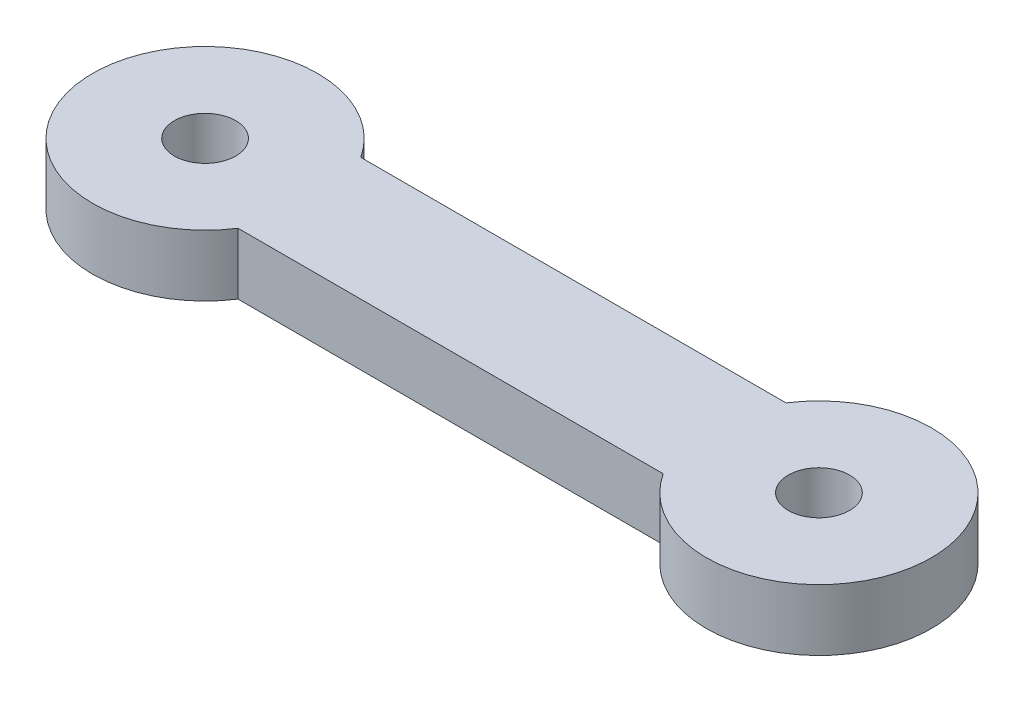
ISO-10303-21;
HEADER;
FILE_DESCRIPTION(('STEP AP214'),'2;1');
FILE_NAME('part.step','',(''),(''),'','','');
FILE_SCHEMA(('AUTOMOTIVE_DESIGN { 1 0 10303 214 1 1 1 1 }'));
ENDSEC;
DATA;
#1=APPLICATION_CONTEXT('core data for automotive mechanical design processes');
#2=APPLICATION_PROTOCOL_DEFINITION('international standard','automotive_design',2000,#1);
#3=PRODUCT_CONTEXT('',#1,'mechanical');
#4=PRODUCT('Part','Part','',(#3));
#5=PRODUCT_RELATED_PRODUCT_CATEGORY('part','',(#4));
#6=PRODUCT_DEFINITION_FORMATION('','',#4);
#7=PRODUCT_DEFINITION_CONTEXT('part definition',#1,'design');
#8=PRODUCT_DEFINITION('design','',#6,#7);
#9=PRODUCT_DEFINITION_SHAPE('','',#8);
#10=(LENGTH_UNIT() NAMED_UNIT(*) SI_UNIT(.MILLI.,.METRE.));
#11=(NAMED_UNIT(*) PLANE_ANGLE_UNIT() SI_UNIT($,.RADIAN.));
#12=(NAMED_UNIT(*) SI_UNIT($,.STERADIAN.) SOLID_ANGLE_UNIT());
#13=UNCERTAINTY_MEASURE_WITH_UNIT(LENGTH_MEASURE(1.E-05),#10,'distance_accuracy_value','');
#14=(GEOMETRIC_REPRESENTATION_CONTEXT(3) GLOBAL_UNCERTAINTY_ASSIGNED_CONTEXT((#13)) GLOBAL_UNIT_ASSIGNED_CONTEXT((#10,
#11,#12)) REPRESENTATION_CONTEXT('',''));
#15=CARTESIAN_POINT('',(0.,0.,0.));
#16=DIRECTION('',(0.,0.,1.));
#17=DIRECTION('',(1.,0.,0.));
#18=AXIS2_PLACEMENT_3D('',#15,#16,#17);
#19=CARTESIAN_POINT('',(0.,3.,3.));
#20=DIRECTION('',(0.,0.,-1.));
#21=DIRECTION('',(-1.,0.,0.));
#22=AXIS2_PLACEMENT_3D('',#19,#20,#21);
#23=PLANE('',#22);
#24=DIRECTION('',(1.,0.,0.));
#25=VECTOR('',#24,1.);
#26=CARTESIAN_POINT('',(0.,0.,3.));
#27=LINE('',#26,#25);
#28=CARTESIAN_POINT('',(4.60977222864644,0.,3.));
#29=VERTEX_POINT('',#28);
#30=CARTESIAN_POINT('',(25.3902277713536,0.,3.));
#31=VERTEX_POINT('',#30);
#32=EDGE_CURVE('E104',#29,#31,#27,.T.);
#33=ORIENTED_EDGE('',*,*,#32,.T.);
#34=DIRECTION('',(0.,-1.,0.));
#35=VECTOR('',#34,1.);
#36=CARTESIAN_POINT('',(25.3902277713536,3.,3.));
#37=LINE('',#36,#35);
#38=CARTESIAN_POINT('',(25.3902277713536,3.,3.));
#39=VERTEX_POINT('',#38);
#40=EDGE_CURVE('E11',#39,#31,#37,.T.);
#41=ORIENTED_EDGE('',*,*,#40,.F.);
#42=DIRECTION('',(1.,0.,0.));
#43=VECTOR('',#42,1.);
#44=CARTESIAN_POINT('',(0.,3.,3.));
#45=LINE('',#44,#43);
#46=CARTESIAN_POINT('',(4.60977222864644,3.,3.));
#47=VERTEX_POINT('',#46);
#48=EDGE_CURVE('E83',#47,#39,#45,.T.);
#49=ORIENTED_EDGE('',*,*,#48,.F.);
#50=DIRECTION('',(0.,-1.,0.));
#51=VECTOR('',#50,1.);
#52=CARTESIAN_POINT('',(4.60977222864644,3.,3.));
#53=LINE('',#52,#51);
#54=EDGE_CURVE('E103',#47,#29,#53,.T.);
#55=ORIENTED_EDGE('',*,*,#54,.T.);
#56=EDGE_LOOP('',(#33,#41,#49,#55));
#57=FACE_BOUND('',#56,.T.);
#58=ADVANCED_FACE('F35',(#57),#23,.F.);
#59=CARTESIAN_POINT('',(30.,3.,0.));
#60=DIRECTION('',(0.,-1.,0.));
#61=DIRECTION('',(0.,0.,-1.));
#62=AXIS2_PLACEMENT_3D('',#59,#60,#61);
#63=CYLINDRICAL_SURFACE('',#62,5.5);
#64=CARTESIAN_POINT('',(30.,0.,0.));
#65=DIRECTION('',(0.,1.,0.));
#66=DIRECTION('',(0.,0.,1.));
#67=AXIS2_PLACEMENT_3D('',#64,#65,#66);
#68=CIRCLE('',#67,5.5);
#69=CARTESIAN_POINT('',(25.3902277713536,0.,-3.));
#70=VERTEX_POINT('',#69);
#71=EDGE_CURVE('E88',#31,#70,#68,.T.);
#72=ORIENTED_EDGE('',*,*,#71,.T.);
#73=DIRECTION('',(0.,-1.,0.));
#74=VECTOR('',#73,1.);
#75=CARTESIAN_POINT('',(25.3902277713536,3.,-3.));
#76=LINE('',#75,#74);
#77=CARTESIAN_POINT('',(25.3902277713536,3.,-3.));
#78=VERTEX_POINT('',#77);
#79=EDGE_CURVE('E43',#78,#70,#76,.T.);
#80=ORIENTED_EDGE('',*,*,#79,.F.);
#81=CARTESIAN_POINT('',(30.,3.,0.));
#82=DIRECTION('',(0.,1.,0.));
#83=DIRECTION('',(0.,0.,1.));
#84=AXIS2_PLACEMENT_3D('',#81,#82,#83);
#85=CIRCLE('',#84,5.5);
#86=EDGE_CURVE('E77',#39,#78,#85,.T.);
#87=ORIENTED_EDGE('',*,*,#86,.F.);
#88=ORIENTED_EDGE('',*,*,#40,.T.);
#89=EDGE_LOOP('',(#72,#80,#87,#88));
#90=FACE_BOUND('',#89,.T.);
#91=ADVANCED_FACE('F87',(#90),#63,.T.);
#92=CARTESIAN_POINT('',(0.,3.,-3.));
#93=DIRECTION('',(0.,0.,-1.));
#94=DIRECTION('',(-1.,0.,0.));
#95=AXIS2_PLACEMENT_3D('',#92,#93,#94);
#96=PLANE('',#95);
#97=DIRECTION('',(1.,0.,0.));
#98=VECTOR('',#97,1.);
#99=CARTESIAN_POINT('',(0.,0.,-3.));
#100=LINE('',#99,#98);
#101=CARTESIAN_POINT('',(4.60977222864644,0.,-3.));
#102=VERTEX_POINT('',#101);
#103=EDGE_CURVE('E108',#102,#70,#100,.T.);
#104=ORIENTED_EDGE('',*,*,#103,.F.);
#105=DIRECTION('',(0.,-1.,0.));
#106=VECTOR('',#105,1.);
#107=CARTESIAN_POINT('',(4.60977222864644,3.,-3.));
#108=LINE('',#107,#106);
#109=CARTESIAN_POINT('',(4.60977222864644,3.,-3.));
#110=VERTEX_POINT('',#109);
#111=EDGE_CURVE('E67',#110,#102,#108,.T.);
#112=ORIENTED_EDGE('',*,*,#111,.F.);
#113=DIRECTION('',(1.,0.,0.));
#114=VECTOR('',#113,1.);
#115=CARTESIAN_POINT('',(0.,3.,-3.));
#116=LINE('',#115,#114);
#117=EDGE_CURVE('E81',#110,#78,#116,.T.);
#118=ORIENTED_EDGE('',*,*,#117,.T.);
#119=ORIENTED_EDGE('',*,*,#79,.T.);
#120=EDGE_LOOP('',(#104,#112,#118,#119));
#121=FACE_BOUND('',#120,.T.);
#122=ADVANCED_FACE('F92',(#121),#96,.T.);
#123=CARTESIAN_POINT('',(0.,3.,0.));
#124=DIRECTION('',(0.,-1.,0.));
#125=DIRECTION('',(0.,0.,-1.));
#126=AXIS2_PLACEMENT_3D('',#123,#124,#125);
#127=CYLINDRICAL_SURFACE('',#126,1.5);
#128=CARTESIAN_POINT('',(0.,3.,0.));
#129=DIRECTION('',(0.,1.,0.));
#130=DIRECTION('',(0.,0.,1.));
#131=AXIS2_PLACEMENT_3D('',#128,#129,#130);
#132=CIRCLE('',#131,1.5);
#133=CARTESIAN_POINT('',(0.,3.,1.5));
#134=VERTEX_POINT('',#133);
#135=EDGE_CURVE('E94',#134,#134,#132,.T.);
#136=ORIENTED_EDGE('',*,*,#135,.T.);
#137=EDGE_LOOP('',(#136));
#138=FACE_BOUND('',#137,.T.);
#139=CARTESIAN_POINT('',(0.,0.,0.));
#140=DIRECTION('',(0.,1.,0.));
#141=DIRECTION('',(0.,0.,1.));
#142=AXIS2_PLACEMENT_3D('',#139,#140,#141);
#143=CIRCLE('',#142,1.5);
#144=CARTESIAN_POINT('',(0.,0.,1.5));
#145=VERTEX_POINT('',#144);
#146=EDGE_CURVE('E111',#145,#145,#143,.T.);
#147=ORIENTED_EDGE('',*,*,#146,.F.);
#148=EDGE_LOOP('',(#147));
#149=FACE_BOUND('',#148,.T.);
#150=ADVANCED_FACE('F139',(#138,#149),#127,.F.);
#151=CARTESIAN_POINT('',(0.,3.,0.));
#152=DIRECTION('',(0.,-1.,0.));
#153=DIRECTION('',(0.,0.,-1.));
#154=AXIS2_PLACEMENT_3D('',#151,#152,#153);
#155=CYLINDRICAL_SURFACE('',#154,5.5);
#156=CARTESIAN_POINT('',(0.,0.,0.));
#157=DIRECTION('',(0.,1.,0.));
#158=DIRECTION('',(0.,0.,1.));
#159=AXIS2_PLACEMENT_3D('',#156,#157,#158);
#160=CIRCLE('',#159,5.5);
#161=EDGE_CURVE('E70',#102,#29,#160,.T.);
#162=ORIENTED_EDGE('',*,*,#161,.T.);
#163=ORIENTED_EDGE('',*,*,#54,.F.);
#164=CARTESIAN_POINT('',(0.,3.,0.));
#165=DIRECTION('',(0.,1.,0.));
#166=DIRECTION('',(0.,0.,1.));
#167=AXIS2_PLACEMENT_3D('',#164,#165,#166);
#168=CIRCLE('',#167,5.5);
#169=EDGE_CURVE('E51',#110,#47,#168,.T.);
#170=ORIENTED_EDGE('',*,*,#169,.F.);
#171=ORIENTED_EDGE('',*,*,#111,.T.);
#172=EDGE_LOOP('',(#162,#163,#170,#171));
#173=FACE_BOUND('',#172,.T.);
#174=ADVANCED_FACE('F131',(#173),#155,.T.);
#175=CARTESIAN_POINT('',(30.,3.,0.));
#176=DIRECTION('',(0.,-1.,0.));
#177=DIRECTION('',(0.,0.,-1.));
#178=AXIS2_PLACEMENT_3D('',#175,#176,#177);
#179=CYLINDRICAL_SURFACE('',#178,1.5);
#180=CARTESIAN_POINT('',(30.,3.,0.));
#181=DIRECTION('',(0.,1.,0.));
#182=DIRECTION('',(0.,0.,1.));
#183=AXIS2_PLACEMENT_3D('',#180,#181,#182);
#184=CIRCLE('',#183,1.5);
#185=CARTESIAN_POINT('',(30.,3.,1.5));
#186=VERTEX_POINT('',#185);
#187=EDGE_CURVE('E100',#186,#186,#184,.T.);
#188=ORIENTED_EDGE('',*,*,#187,.T.);
#189=EDGE_LOOP('',(#188));
#190=FACE_BOUND('',#189,.T.);
#191=CARTESIAN_POINT('',(30.,0.,0.));
#192=DIRECTION('',(0.,1.,0.));
#193=DIRECTION('',(0.,0.,1.));
#194=AXIS2_PLACEMENT_3D('',#191,#192,#193);
#195=CIRCLE('',#194,1.5);
#196=CARTESIAN_POINT('',(30.,0.,1.5));
#197=VERTEX_POINT('',#196);
#198=EDGE_CURVE('E114',#197,#197,#195,.T.);
#199=ORIENTED_EDGE('',*,*,#198,.F.);
#200=EDGE_LOOP('',(#199));
#201=FACE_BOUND('',#200,.T.);
#202=ADVANCED_FACE('F129',(#190,#201),#179,.F.);
#203=CARTESIAN_POINT('',(0.,3.,0.));
#204=DIRECTION('',(0.,1.,0.));
#205=DIRECTION('',(0.,0.,1.));
#206=AXIS2_PLACEMENT_3D('',#203,#204,#205);
#207=PLANE('',#206);
#208=ORIENTED_EDGE('',*,*,#48,.T.);
#209=ORIENTED_EDGE('',*,*,#86,.T.);
#210=ORIENTED_EDGE('',*,*,#117,.F.);
#211=ORIENTED_EDGE('',*,*,#169,.T.);
#212=EDGE_LOOP('',(#208,#209,#210,#211));
#213=FACE_BOUND('',#212,.T.);
#214=ORIENTED_EDGE('',*,*,#135,.F.);
#215=EDGE_LOOP('',(#214));
#216=FACE_BOUND('',#215,.T.);
#217=ORIENTED_EDGE('',*,*,#187,.F.);
#218=EDGE_LOOP('',(#217));
#219=FACE_BOUND('',#218,.T.);
#220=ADVANCED_FACE('F78',(#213,#216,#219),#207,.T.);
#221=CARTESIAN_POINT('',(0.,0.,0.));
#222=DIRECTION('',(0.,1.,0.));
#223=DIRECTION('',(0.,0.,1.));
#224=AXIS2_PLACEMENT_3D('',#221,#222,#223);
#225=PLANE('',#224);
#226=ORIENTED_EDGE('',*,*,#32,.F.);
#227=ORIENTED_EDGE('',*,*,#161,.F.);
#228=ORIENTED_EDGE('',*,*,#103,.T.);
#229=ORIENTED_EDGE('',*,*,#71,.F.);
#230=EDGE_LOOP('',(#226,#227,#228,#229));
#231=FACE_BOUND('',#230,.T.);
#232=ORIENTED_EDGE('',*,*,#146,.T.);
#233=EDGE_LOOP('',(#232));
#234=FACE_BOUND('',#233,.T.);
#235=ORIENTED_EDGE('',*,*,#198,.T.);
#236=EDGE_LOOP('',(#235));
#237=FACE_BOUND('',#236,.T.);
#238=ADVANCED_FACE('F121',(#231,#234,#237),#225,.F.);
#239=CLOSED_SHELL('',(#58,#91,#122,#150,#174,#202,#220,#238));
#240=MANIFOLD_SOLID_BREP('B2',#239);
#241=ADVANCED_BREP_SHAPE_REPRESENTATION('',(#18,#240),#14);
#242=SHAPE_DEFINITION_REPRESENTATION(#9,#241);
ENDSEC;
END-ISO-10303-21;
